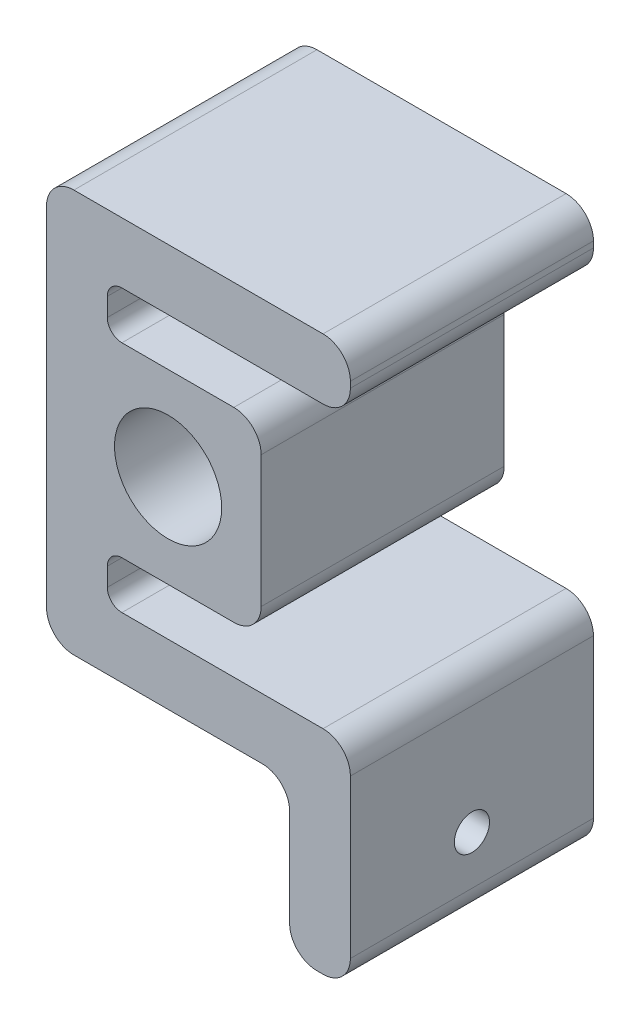
ISO-10303-21;
HEADER;
FILE_DESCRIPTION(('STEP AP214'),'2;1');
FILE_NAME('part.step','',(''),(''),'','','');
FILE_SCHEMA(('AUTOMOTIVE_DESIGN { 1 0 10303 214 1 1 1 1 }'));
ENDSEC;
DATA;
#1=APPLICATION_CONTEXT('core data for automotive mechanical design processes');
#2=APPLICATION_PROTOCOL_DEFINITION('international standard','automotive_design',2000,#1);
#3=PRODUCT_CONTEXT('',#1,'mechanical');
#4=PRODUCT('Part','Part','',(#3));
#5=PRODUCT_RELATED_PRODUCT_CATEGORY('part','',(#4));
#6=PRODUCT_DEFINITION_FORMATION('','',#4);
#7=PRODUCT_DEFINITION_CONTEXT('part definition',#1,'design');
#8=PRODUCT_DEFINITION('design','',#6,#7);
#9=PRODUCT_DEFINITION_SHAPE('','',#8);
#10=(LENGTH_UNIT() NAMED_UNIT(*) SI_UNIT(.MILLI.,.METRE.));
#11=(NAMED_UNIT(*) PLANE_ANGLE_UNIT() SI_UNIT($,.RADIAN.));
#12=(NAMED_UNIT(*) SI_UNIT($,.STERADIAN.) SOLID_ANGLE_UNIT());
#13=UNCERTAINTY_MEASURE_WITH_UNIT(LENGTH_MEASURE(1.E-05),#10,'distance_accuracy_value','');
#14=(GEOMETRIC_REPRESENTATION_CONTEXT(3) GLOBAL_UNCERTAINTY_ASSIGNED_CONTEXT((#13)) GLOBAL_UNIT_ASSIGNED_CONTEXT((#10,
#11,#12)) REPRESENTATION_CONTEXT('',''));
#15=CARTESIAN_POINT('',(0.,0.,0.));
#16=DIRECTION('',(0.,0.,1.));
#17=DIRECTION('',(1.,0.,0.));
#18=AXIS2_PLACEMENT_3D('',#15,#16,#17);
#19=CARTESIAN_POINT('',(-19.685,-36.364999962,50.8));
#20=DIRECTION('',(0.,0.,1.));
#21=DIRECTION('',(1.,0.,0.));
#22=AXIS2_PLACEMENT_3D('',#19,#20,#21);
#23=PLANE('',#22);
#24=CARTESIAN_POINT('',(-19.685,-36.364999962,50.8));
#25=DIRECTION('',(0.,0.,1.));
#26=DIRECTION('',(1.,0.,0.));
#27=AXIS2_PLACEMENT_3D('',#24,#25,#26);
#28=CIRCLE('',#27,5.715);
#29=CARTESIAN_POINT('',(-25.4,-36.364999962,50.8));
#30=VERTEX_POINT('',#29);
#31=CARTESIAN_POINT('',(-19.685,-42.079999962,50.8));
#32=VERTEX_POINT('',#31);
#33=EDGE_CURVE('E319',#30,#32,#28,.T.);
#34=ORIENTED_EDGE('',*,*,#33,.T.);
#35=DIRECTION('',(1.,0.,0.));
#36=VECTOR('',#35,1.);
#37=CARTESIAN_POINT('',(-19.685,-42.079999962,50.8));
#38=LINE('',#37,#36);
#39=CARTESIAN_POINT('',(19.685,-42.079999962,50.8));
#40=VERTEX_POINT('',#39);
#41=EDGE_CURVE('E164',#32,#40,#38,.T.);
#42=ORIENTED_EDGE('',*,*,#41,.T.);
#43=CARTESIAN_POINT('',(19.685,-47.794999962,50.8));
#44=DIRECTION('',(0.,0.,-1.));
#45=DIRECTION('',(-1.,0.,0.));
#46=AXIS2_PLACEMENT_3D('',#43,#44,#45);
#47=CIRCLE('',#46,5.715);
#48=CARTESIAN_POINT('',(25.4,-47.794999962,50.8));
#49=VERTEX_POINT('',#48);
#50=EDGE_CURVE('E395',#40,#49,#47,.T.);
#51=ORIENTED_EDGE('',*,*,#50,.T.);
#52=DIRECTION('',(0.,-1.,0.));
#53=VECTOR('',#52,1.);
#54=CARTESIAN_POINT('',(25.4,-68.114999962,50.8));
#55=LINE('',#54,#53);
#56=CARTESIAN_POINT('',(25.4,-68.114999962,50.8));
#57=VERTEX_POINT('',#56);
#58=EDGE_CURVE('E414',#49,#57,#55,.T.);
#59=ORIENTED_EDGE('',*,*,#58,.T.);
#60=CARTESIAN_POINT('',(31.115,-68.114999962,50.8));
#61=DIRECTION('',(0.,0.,1.));
#62=DIRECTION('',(-1.,0.,0.));
#63=AXIS2_PLACEMENT_3D('',#60,#61,#62);
#64=CIRCLE('',#63,5.71499999999999);
#65=CARTESIAN_POINT('',(31.115,-73.829999962,50.8));
#66=VERTEX_POINT('',#65);
#67=EDGE_CURVE('E411',#57,#66,#64,.T.);
#68=ORIENTED_EDGE('',*,*,#67,.T.);
#69=DIRECTION('',(1.,0.,0.));
#70=VECTOR('',#69,1.);
#71=CARTESIAN_POINT('',(32.385,-73.829999962,50.8));
#72=LINE('',#71,#70);
#73=CARTESIAN_POINT('',(32.385,-73.829999962,50.8));
#74=VERTEX_POINT('',#73);
#75=EDGE_CURVE('E413',#66,#74,#72,.T.);
#76=ORIENTED_EDGE('',*,*,#75,.T.);
#77=CARTESIAN_POINT('',(32.385,-68.114999962,50.8));
#78=DIRECTION('',(0.,0.,1.));
#79=DIRECTION('',(-1.,0.,0.));
#80=AXIS2_PLACEMENT_3D('',#77,#78,#79);
#81=CIRCLE('',#80,5.71499999999999);
#82=CARTESIAN_POINT('',(38.1,-68.114999962,50.8));
#83=VERTEX_POINT('',#82);
#84=EDGE_CURVE('E416',#74,#83,#81,.T.);
#85=ORIENTED_EDGE('',*,*,#84,.T.);
#86=DIRECTION('',(0.,1.,0.));
#87=VECTOR('',#86,1.);
#88=CARTESIAN_POINT('',(38.1,-68.114999962,50.8));
#89=LINE('',#88,#87);
#90=CARTESIAN_POINT('',(38.1,-35.094999962,50.8));
#91=VERTEX_POINT('',#90);
#92=EDGE_CURVE('E422',#83,#91,#89,.T.);
#93=ORIENTED_EDGE('',*,*,#92,.T.);
#94=CARTESIAN_POINT('',(32.385,-35.094999962,50.8));
#95=DIRECTION('',(0.,0.,1.));
#96=DIRECTION('',(1.,0.,0.));
#97=AXIS2_PLACEMENT_3D('',#94,#95,#96);
#98=CIRCLE('',#97,5.71499999999999);
#99=CARTESIAN_POINT('',(32.385,-29.379999962,50.8));
#100=VERTEX_POINT('',#99);
#101=EDGE_CURVE('E424',#91,#100,#98,.T.);
#102=ORIENTED_EDGE('',*,*,#101,.T.);
#103=DIRECTION('',(-1.,0.,0.));
#104=VECTOR('',#103,1.);
#105=CARTESIAN_POINT('',(32.385,-29.379999962,50.8));
#106=LINE('',#105,#104);
#107=CARTESIAN_POINT('',(-9.65199999999999,-29.379999962,50.8));
#108=VERTEX_POINT('',#107);
#109=EDGE_CURVE('E426',#100,#108,#106,.T.);
#110=ORIENTED_EDGE('',*,*,#109,.T.);
#111=CARTESIAN_POINT('',(-9.65199999999999,-26.331999962,50.8));
#112=DIRECTION('',(0.,0.,-1.));
#113=DIRECTION('',(-1.,0.,0.));
#114=AXIS2_PLACEMENT_3D('',#111,#112,#113);
#115=CIRCLE('',#114,3.048);
#116=CARTESIAN_POINT('',(-12.7,-26.331999962,50.8));
#117=VERTEX_POINT('',#116);
#118=EDGE_CURVE('E428',#108,#117,#115,.T.);
#119=ORIENTED_EDGE('',*,*,#118,.T.);
#120=DIRECTION('',(0.,1.,0.));
#121=VECTOR('',#120,1.);
#122=CARTESIAN_POINT('',(-12.7,-26.331999962,50.8));
#123=LINE('',#122,#121);
#124=CARTESIAN_POINT('',(-12.7,-22.503,50.8));
#125=VERTEX_POINT('',#124);
#126=EDGE_CURVE('E430',#117,#125,#123,.T.);
#127=ORIENTED_EDGE('',*,*,#126,.T.);
#128=CARTESIAN_POINT('',(-9.65199999999999,-22.503,50.8));
#129=DIRECTION('',(0.,0.,-1.));
#130=DIRECTION('',(-1.,0.,0.));
#131=AXIS2_PLACEMENT_3D('',#128,#129,#130);
#132=CIRCLE('',#131,3.048);
#133=CARTESIAN_POINT('',(-9.65199999999999,-19.455,50.8));
#134=VERTEX_POINT('',#133);
#135=EDGE_CURVE('E432',#125,#134,#132,.T.);
#136=ORIENTED_EDGE('',*,*,#135,.T.);
#137=DIRECTION('',(1.,0.,0.));
#138=VECTOR('',#137,1.);
#139=CARTESIAN_POINT('',(-9.65199999999999,-19.455,50.8));
#140=LINE('',#139,#138);
#141=CARTESIAN_POINT('',(13.74,-19.455,50.8));
#142=VERTEX_POINT('',#141);
#143=EDGE_CURVE('E434',#134,#142,#140,.T.);
#144=ORIENTED_EDGE('',*,*,#143,.T.);
#145=CARTESIAN_POINT('',(13.74,-13.74,50.8));
#146=DIRECTION('',(0.,0.,1.));
#147=DIRECTION('',(-1.,0.,0.));
#148=AXIS2_PLACEMENT_3D('',#145,#146,#147);
#149=CIRCLE('',#148,5.715);
#150=CARTESIAN_POINT('',(19.455,-13.74,50.8));
#151=VERTEX_POINT('',#150);
#152=EDGE_CURVE('E436',#142,#151,#149,.T.);
#153=ORIENTED_EDGE('',*,*,#152,.T.);
#154=DIRECTION('',(0.,1.,0.));
#155=VECTOR('',#154,1.);
#156=CARTESIAN_POINT('',(19.455,0.,50.8));
#157=LINE('',#156,#155);
#158=CARTESIAN_POINT('',(19.455,13.74,50.8));
#159=VERTEX_POINT('',#158);
#160=EDGE_CURVE('E438',#151,#159,#157,.T.);
#161=ORIENTED_EDGE('',*,*,#160,.T.);
#162=CARTESIAN_POINT('',(13.74,13.74,50.8));
#163=DIRECTION('',(0.,0.,1.));
#164=DIRECTION('',(-1.,0.,0.));
#165=AXIS2_PLACEMENT_3D('',#162,#163,#164);
#166=CIRCLE('',#165,5.715);
#167=CARTESIAN_POINT('',(13.74,19.455,50.8));
#168=VERTEX_POINT('',#167);
#169=EDGE_CURVE('E440',#159,#168,#166,.T.);
#170=ORIENTED_EDGE('',*,*,#169,.T.);
#171=DIRECTION('',(-1.,0.,0.));
#172=VECTOR('',#171,1.);
#173=CARTESIAN_POINT('',(0.,19.455,50.8));
#174=LINE('',#173,#172);
#175=CARTESIAN_POINT('',(-9.65199999999999,19.455,50.8));
#176=VERTEX_POINT('',#175);
#177=EDGE_CURVE('E442',#168,#176,#174,.T.);
#178=ORIENTED_EDGE('',*,*,#177,.T.);
#179=CARTESIAN_POINT('',(-9.65199999999999,22.503,50.8));
#180=DIRECTION('',(0.,0.,-1.));
#181=DIRECTION('',(-1.,0.,0.));
#182=AXIS2_PLACEMENT_3D('',#179,#180,#181);
#183=CIRCLE('',#182,3.048);
#184=CARTESIAN_POINT('',(-12.7,22.503,50.8));
#185=VERTEX_POINT('',#184);
#186=EDGE_CURVE('E444',#176,#185,#183,.T.);
#187=ORIENTED_EDGE('',*,*,#186,.T.);
#188=DIRECTION('',(0.,1.,0.));
#189=VECTOR('',#188,1.);
#190=CARTESIAN_POINT('',(-12.7,22.503,50.8));
#191=LINE('',#190,#189);
#192=CARTESIAN_POINT('',(-12.7,26.332,50.8));
#193=VERTEX_POINT('',#192);
#194=EDGE_CURVE('E446',#185,#193,#191,.T.);
#195=ORIENTED_EDGE('',*,*,#194,.T.);
#196=CARTESIAN_POINT('',(-9.65199999999999,26.332,50.8));
#197=DIRECTION('',(0.,0.,-1.));
#198=DIRECTION('',(-1.,0.,0.));
#199=AXIS2_PLACEMENT_3D('',#196,#197,#198);
#200=CIRCLE('',#199,3.048);
#201=CARTESIAN_POINT('',(-9.65199999999999,29.38,50.8));
#202=VERTEX_POINT('',#201);
#203=EDGE_CURVE('E448',#193,#202,#200,.T.);
#204=ORIENTED_EDGE('',*,*,#203,.T.);
#205=DIRECTION('',(1.,0.,0.));
#206=VECTOR('',#205,1.);
#207=CARTESIAN_POINT('',(-9.65199999999999,29.38,50.8));
#208=LINE('',#207,#206);
#209=CARTESIAN_POINT('',(32.385,29.38,50.8));
#210=VERTEX_POINT('',#209);
#211=EDGE_CURVE('E450',#202,#210,#208,.T.);
#212=ORIENTED_EDGE('',*,*,#211,.T.);
#213=CARTESIAN_POINT('',(32.385,35.095,50.8));
#214=DIRECTION('',(0.,0.,1.));
#215=DIRECTION('',(1.,0.,0.));
#216=AXIS2_PLACEMENT_3D('',#213,#214,#215);
#217=CIRCLE('',#216,5.715);
#218=CARTESIAN_POINT('',(38.1,35.095,50.8));
#219=VERTEX_POINT('',#218);
#220=EDGE_CURVE('E452',#210,#219,#217,.T.);
#221=ORIENTED_EDGE('',*,*,#220,.T.);
#222=DIRECTION('',(0.,1.,0.));
#223=VECTOR('',#222,1.);
#224=CARTESIAN_POINT('',(38.1,35.095,50.8));
#225=LINE('',#224,#223);
#226=CARTESIAN_POINT('',(38.1,36.365,50.8));
#227=VERTEX_POINT('',#226);
#228=EDGE_CURVE('E454',#219,#227,#225,.T.);
#229=ORIENTED_EDGE('',*,*,#228,.T.);
#230=CARTESIAN_POINT('',(32.385,36.365,50.8));
#231=DIRECTION('',(0.,0.,1.));
#232=DIRECTION('',(1.,0.,0.));
#233=AXIS2_PLACEMENT_3D('',#230,#231,#232);
#234=CIRCLE('',#233,5.715);
#235=CARTESIAN_POINT('',(32.385,42.08,50.8));
#236=VERTEX_POINT('',#235);
#237=EDGE_CURVE('E243',#227,#236,#234,.T.);
#238=ORIENTED_EDGE('',*,*,#237,.T.);
#239=DIRECTION('',(-1.,0.,0.));
#240=VECTOR('',#239,1.);
#241=CARTESIAN_POINT('',(32.385,42.08,50.8));
#242=LINE('',#241,#240);
#243=CARTESIAN_POINT('',(-19.685,42.08,50.8));
#244=VERTEX_POINT('',#243);
#245=EDGE_CURVE('E237',#236,#244,#242,.T.);
#246=ORIENTED_EDGE('',*,*,#245,.T.);
#247=CARTESIAN_POINT('',(-19.685,36.365,50.8));
#248=DIRECTION('',(0.,0.,1.));
#249=DIRECTION('',(1.,0.,0.));
#250=AXIS2_PLACEMENT_3D('',#247,#248,#249);
#251=CIRCLE('',#250,5.71499999999999);
#252=CARTESIAN_POINT('',(-25.4,36.365,50.8));
#253=VERTEX_POINT('',#252);
#254=EDGE_CURVE('E241',#244,#253,#251,.T.);
#255=ORIENTED_EDGE('',*,*,#254,.T.);
#256=DIRECTION('',(0.,-1.,0.));
#257=VECTOR('',#256,1.);
#258=CARTESIAN_POINT('',(-25.4,-36.364999962,50.8));
#259=LINE('',#258,#257);
#260=EDGE_CURVE('E61',#253,#30,#259,.T.);
#261=ORIENTED_EDGE('',*,*,#260,.T.);
#262=EDGE_LOOP('',(#34,#42,#51,#59,#68,#76,#85,#93,#102,#110,#119,#127,#136,#144,#153,#161,#170,
#178,#187,#195,#204,#212,#221,#229,#238,#246,#255,#261));
#263=FACE_BOUND('',#262,.T.);
#264=CARTESIAN_POINT('',(0.,0.,50.8));
#265=DIRECTION('',(0.,0.,1.));
#266=DIRECTION('',(1.,0.,0.));
#267=AXIS2_PLACEMENT_3D('',#264,#265,#266);
#268=CIRCLE('',#267,11.2);
#269=CARTESIAN_POINT('',(11.2,0.,50.8));
#270=VERTEX_POINT('',#269);
#271=EDGE_CURVE('E265',#270,#270,#268,.T.);
#272=ORIENTED_EDGE('',*,*,#271,.F.);
#273=EDGE_LOOP('',(#272));
#274=FACE_BOUND('',#273,.T.);
#275=ADVANCED_FACE('F43',(#263,#274),#23,.T.);
#276=CARTESIAN_POINT('',(-19.685,-36.364999962,0.));
#277=DIRECTION('',(0.,0.,1.));
#278=DIRECTION('',(1.,0.,0.));
#279=AXIS2_PLACEMENT_3D('',#276,#277,#278);
#280=PLANE('',#279);
#281=CARTESIAN_POINT('',(-19.685,-36.364999962,0.));
#282=DIRECTION('',(0.,0.,1.));
#283=DIRECTION('',(1.,0.,0.));
#284=AXIS2_PLACEMENT_3D('',#281,#282,#283);
#285=CIRCLE('',#284,5.715);
#286=CARTESIAN_POINT('',(-25.4,-36.364999962,0.));
#287=VERTEX_POINT('',#286);
#288=CARTESIAN_POINT('',(-19.685,-42.079999962,0.));
#289=VERTEX_POINT('',#288);
#290=EDGE_CURVE('E261',#287,#289,#285,.T.);
#291=ORIENTED_EDGE('',*,*,#290,.F.);
#292=DIRECTION('',(0.,-1.,0.));
#293=VECTOR('',#292,1.);
#294=CARTESIAN_POINT('',(-25.4,-36.364999962,0.));
#295=LINE('',#294,#293);
#296=CARTESIAN_POINT('',(-25.4,36.365,0.));
#297=VERTEX_POINT('',#296);
#298=EDGE_CURVE('E156',#297,#287,#295,.T.);
#299=ORIENTED_EDGE('',*,*,#298,.F.);
#300=CARTESIAN_POINT('',(-19.685,36.365,0.));
#301=DIRECTION('',(0.,0.,1.));
#302=DIRECTION('',(1.,0.,0.));
#303=AXIS2_PLACEMENT_3D('',#300,#301,#302);
#304=CIRCLE('',#303,5.71499999999999);
#305=CARTESIAN_POINT('',(-19.685,42.08,0.));
#306=VERTEX_POINT('',#305);
#307=EDGE_CURVE('E150',#306,#297,#304,.T.);
#308=ORIENTED_EDGE('',*,*,#307,.F.);
#309=DIRECTION('',(-1.,0.,0.));
#310=VECTOR('',#309,1.);
#311=CARTESIAN_POINT('',(32.385,42.08,0.));
#312=LINE('',#311,#310);
#313=CARTESIAN_POINT('',(32.385,42.08,0.));
#314=VERTEX_POINT('',#313);
#315=EDGE_CURVE('E251',#314,#306,#312,.T.);
#316=ORIENTED_EDGE('',*,*,#315,.F.);
#317=CARTESIAN_POINT('',(32.385,36.365,0.));
#318=DIRECTION('',(0.,0.,1.));
#319=DIRECTION('',(1.,0.,0.));
#320=AXIS2_PLACEMENT_3D('',#317,#318,#319);
#321=CIRCLE('',#320,5.715);
#322=CARTESIAN_POINT('',(38.1,36.365,0.));
#323=VERTEX_POINT('',#322);
#324=EDGE_CURVE('E314',#323,#314,#321,.T.);
#325=ORIENTED_EDGE('',*,*,#324,.F.);
#326=DIRECTION('',(0.,1.,0.));
#327=VECTOR('',#326,1.);
#328=CARTESIAN_POINT('',(38.1,35.095,0.));
#329=LINE('',#328,#327);
#330=CARTESIAN_POINT('',(38.1,35.095,0.));
#331=VERTEX_POINT('',#330);
#332=EDGE_CURVE('E312',#331,#323,#329,.T.);
#333=ORIENTED_EDGE('',*,*,#332,.F.);
#334=CARTESIAN_POINT('',(32.385,35.095,0.));
#335=DIRECTION('',(0.,0.,1.));
#336=DIRECTION('',(1.,0.,0.));
#337=AXIS2_PLACEMENT_3D('',#334,#335,#336);
#338=CIRCLE('',#337,5.715);
#339=CARTESIAN_POINT('',(32.385,29.38,0.));
#340=VERTEX_POINT('',#339);
#341=EDGE_CURVE('E310',#340,#331,#338,.T.);
#342=ORIENTED_EDGE('',*,*,#341,.F.);
#343=DIRECTION('',(1.,0.,0.));
#344=VECTOR('',#343,1.);
#345=CARTESIAN_POINT('',(-9.65199999999999,29.38,0.));
#346=LINE('',#345,#344);
#347=CARTESIAN_POINT('',(-9.65199999999999,29.38,0.));
#348=VERTEX_POINT('',#347);
#349=EDGE_CURVE('E308',#348,#340,#346,.T.);
#350=ORIENTED_EDGE('',*,*,#349,.F.);
#351=CARTESIAN_POINT('',(-9.65199999999999,26.332,0.));
#352=DIRECTION('',(0.,0.,-1.));
#353=DIRECTION('',(-1.,0.,0.));
#354=AXIS2_PLACEMENT_3D('',#351,#352,#353);
#355=CIRCLE('',#354,3.048);
#356=CARTESIAN_POINT('',(-12.7,26.332,0.));
#357=VERTEX_POINT('',#356);
#358=EDGE_CURVE('E306',#357,#348,#355,.T.);
#359=ORIENTED_EDGE('',*,*,#358,.F.);
#360=DIRECTION('',(0.,1.,0.));
#361=VECTOR('',#360,1.);
#362=CARTESIAN_POINT('',(-12.7,22.503,0.));
#363=LINE('',#362,#361);
#364=CARTESIAN_POINT('',(-12.7,22.503,0.));
#365=VERTEX_POINT('',#364);
#366=EDGE_CURVE('E304',#365,#357,#363,.T.);
#367=ORIENTED_EDGE('',*,*,#366,.F.);
#368=CARTESIAN_POINT('',(-9.65199999999999,22.503,0.));
#369=DIRECTION('',(0.,0.,-1.));
#370=DIRECTION('',(-1.,0.,0.));
#371=AXIS2_PLACEMENT_3D('',#368,#369,#370);
#372=CIRCLE('',#371,3.048);
#373=CARTESIAN_POINT('',(-9.65199999999999,19.455,0.));
#374=VERTEX_POINT('',#373);
#375=EDGE_CURVE('E302',#374,#365,#372,.T.);
#376=ORIENTED_EDGE('',*,*,#375,.F.);
#377=DIRECTION('',(-1.,0.,0.));
#378=VECTOR('',#377,1.);
#379=CARTESIAN_POINT('',(-9.65199999999999,19.455,0.));
#380=LINE('',#379,#378);
#381=CARTESIAN_POINT('',(13.74,19.455,0.));
#382=VERTEX_POINT('',#381);
#383=EDGE_CURVE('E300',#382,#374,#380,.T.);
#384=ORIENTED_EDGE('',*,*,#383,.F.);
#385=CARTESIAN_POINT('',(13.74,13.74,0.));
#386=DIRECTION('',(0.,0.,1.));
#387=DIRECTION('',(-1.,0.,0.));
#388=AXIS2_PLACEMENT_3D('',#385,#386,#387);
#389=CIRCLE('',#388,5.715);
#390=CARTESIAN_POINT('',(19.455,13.74,0.));
#391=VERTEX_POINT('',#390);
#392=EDGE_CURVE('E297',#391,#382,#389,.T.);
#393=ORIENTED_EDGE('',*,*,#392,.F.);
#394=DIRECTION('',(0.,1.,0.));
#395=VECTOR('',#394,1.);
#396=CARTESIAN_POINT('',(19.455,13.74,0.));
#397=LINE('',#396,#395);
#398=CARTESIAN_POINT('',(19.455,-13.74,0.));
#399=VERTEX_POINT('',#398);
#400=EDGE_CURVE('E295',#399,#391,#397,.T.);
#401=ORIENTED_EDGE('',*,*,#400,.F.);
#402=CARTESIAN_POINT('',(13.74,-13.74,0.));
#403=DIRECTION('',(0.,0.,1.));
#404=DIRECTION('',(-1.,0.,0.));
#405=AXIS2_PLACEMENT_3D('',#402,#403,#404);
#406=CIRCLE('',#405,5.715);
#407=CARTESIAN_POINT('',(13.74,-19.455,0.));
#408=VERTEX_POINT('',#407);
#409=EDGE_CURVE('E292',#408,#399,#406,.T.);
#410=ORIENTED_EDGE('',*,*,#409,.F.);
#411=DIRECTION('',(1.,0.,0.));
#412=VECTOR('',#411,1.);
#413=CARTESIAN_POINT('',(13.74,-19.455,0.));
#414=LINE('',#413,#412);
#415=CARTESIAN_POINT('',(-9.65199999999999,-19.455,0.));
#416=VERTEX_POINT('',#415);
#417=EDGE_CURVE('E290',#416,#408,#414,.T.);
#418=ORIENTED_EDGE('',*,*,#417,.F.);
#419=CARTESIAN_POINT('',(-9.65199999999999,-22.503,0.));
#420=DIRECTION('',(0.,0.,-1.));
#421=DIRECTION('',(-1.,0.,0.));
#422=AXIS2_PLACEMENT_3D('',#419,#420,#421);
#423=CIRCLE('',#422,3.048);
#424=CARTESIAN_POINT('',(-12.7,-22.503,0.));
#425=VERTEX_POINT('',#424);
#426=EDGE_CURVE('E287',#425,#416,#423,.T.);
#427=ORIENTED_EDGE('',*,*,#426,.F.);
#428=DIRECTION('',(0.,1.,0.));
#429=VECTOR('',#428,1.);
#430=CARTESIAN_POINT('',(-12.7,-26.331999962,0.));
#431=LINE('',#430,#429);
#432=CARTESIAN_POINT('',(-12.7,-26.331999962,0.));
#433=VERTEX_POINT('',#432);
#434=EDGE_CURVE('E285',#433,#425,#431,.T.);
#435=ORIENTED_EDGE('',*,*,#434,.F.);
#436=CARTESIAN_POINT('',(-9.65199999999999,-26.331999962,0.));
#437=DIRECTION('',(0.,0.,-1.));
#438=DIRECTION('',(-1.,0.,0.));
#439=AXIS2_PLACEMENT_3D('',#436,#437,#438);
#440=CIRCLE('',#439,3.048);
#441=CARTESIAN_POINT('',(-9.65199999999999,-29.379999962,0.));
#442=VERTEX_POINT('',#441);
#443=EDGE_CURVE('E283',#442,#433,#440,.T.);
#444=ORIENTED_EDGE('',*,*,#443,.F.);
#445=DIRECTION('',(-1.,0.,0.));
#446=VECTOR('',#445,1.);
#447=CARTESIAN_POINT('',(32.385,-29.379999962,0.));
#448=LINE('',#447,#446);
#449=CARTESIAN_POINT('',(32.385,-29.379999962,0.));
#450=VERTEX_POINT('',#449);
#451=EDGE_CURVE('E281',#450,#442,#448,.T.);
#452=ORIENTED_EDGE('',*,*,#451,.F.);
#453=CARTESIAN_POINT('',(32.385,-35.094999962,0.));
#454=DIRECTION('',(0.,0.,1.));
#455=DIRECTION('',(1.,0.,0.));
#456=AXIS2_PLACEMENT_3D('',#453,#454,#455);
#457=CIRCLE('',#456,5.71499999999999);
#458=CARTESIAN_POINT('',(38.1,-35.094999962,0.));
#459=VERTEX_POINT('',#458);
#460=EDGE_CURVE('E279',#459,#450,#457,.T.);
#461=ORIENTED_EDGE('',*,*,#460,.F.);
#462=DIRECTION('',(0.,1.,0.));
#463=VECTOR('',#462,1.);
#464=CARTESIAN_POINT('',(38.1,-68.114999962,0.));
#465=LINE('',#464,#463);
#466=CARTESIAN_POINT('',(38.1,-68.114999962,0.));
#467=VERTEX_POINT('',#466);
#468=EDGE_CURVE('E277',#467,#459,#465,.T.);
#469=ORIENTED_EDGE('',*,*,#468,.F.);
#470=CARTESIAN_POINT('',(32.385,-68.114999962,0.));
#471=DIRECTION('',(0.,0.,1.));
#472=DIRECTION('',(-1.,0.,0.));
#473=AXIS2_PLACEMENT_3D('',#470,#471,#472);
#474=CIRCLE('',#473,5.71499999999999);
#475=CARTESIAN_POINT('',(32.385,-73.829999962,0.));
#476=VERTEX_POINT('',#475);
#477=EDGE_CURVE('E275',#476,#467,#474,.T.);
#478=ORIENTED_EDGE('',*,*,#477,.F.);
#479=DIRECTION('',(1.,0.,0.));
#480=VECTOR('',#479,1.);
#481=CARTESIAN_POINT('',(32.385,-73.829999962,0.));
#482=LINE('',#481,#480);
#483=CARTESIAN_POINT('',(31.115,-73.829999962,0.));
#484=VERTEX_POINT('',#483);
#485=EDGE_CURVE('E273',#484,#476,#482,.T.);
#486=ORIENTED_EDGE('',*,*,#485,.F.);
#487=CARTESIAN_POINT('',(31.115,-68.114999962,0.));
#488=DIRECTION('',(0.,0.,1.));
#489=DIRECTION('',(-1.,0.,0.));
#490=AXIS2_PLACEMENT_3D('',#487,#488,#489);
#491=CIRCLE('',#490,5.71499999999999);
#492=CARTESIAN_POINT('',(25.4,-68.114999962,0.));
#493=VERTEX_POINT('',#492);
#494=EDGE_CURVE('E271',#493,#484,#491,.T.);
#495=ORIENTED_EDGE('',*,*,#494,.F.);
#496=DIRECTION('',(0.,-1.,0.));
#497=VECTOR('',#496,1.);
#498=CARTESIAN_POINT('',(25.4,-68.114999962,0.));
#499=LINE('',#498,#497);
#500=CARTESIAN_POINT('',(25.4,-47.794999962,0.));
#501=VERTEX_POINT('',#500);
#502=EDGE_CURVE('E269',#501,#493,#499,.T.);
#503=ORIENTED_EDGE('',*,*,#502,.F.);
#504=CARTESIAN_POINT('',(19.685,-47.794999962,0.));
#505=DIRECTION('',(0.,0.,-1.));
#506=DIRECTION('',(-1.,0.,0.));
#507=AXIS2_PLACEMENT_3D('',#504,#505,#506);
#508=CIRCLE('',#507,5.715);
#509=CARTESIAN_POINT('',(19.685,-42.079999962,0.));
#510=VERTEX_POINT('',#509);
#511=EDGE_CURVE('E267',#510,#501,#508,.T.);
#512=ORIENTED_EDGE('',*,*,#511,.F.);
#513=DIRECTION('',(1.,0.,0.));
#514=VECTOR('',#513,1.);
#515=CARTESIAN_POINT('',(-19.685,-42.079999962,0.));
#516=LINE('',#515,#514);
#517=EDGE_CURVE('E264',#289,#510,#516,.T.);
#518=ORIENTED_EDGE('',*,*,#517,.F.);
#519=EDGE_LOOP('',(#291,#299,#308,#316,#325,#333,#342,#350,#359,#367,#376,#384,#393,#401,#410,
#418,#427,#435,#444,#452,#461,#469,#478,#486,#495,#503,#512,#518));
#520=FACE_BOUND('',#519,.T.);
#521=CARTESIAN_POINT('',(0.,0.,0.));
#522=DIRECTION('',(0.,0.,1.));
#523=DIRECTION('',(1.,0.,0.));
#524=AXIS2_PLACEMENT_3D('',#521,#522,#523);
#525=CIRCLE('',#524,11.2);
#526=CARTESIAN_POINT('',(11.2,0.,0.));
#527=VERTEX_POINT('',#526);
#528=EDGE_CURVE('E499',#527,#527,#525,.T.);
#529=ORIENTED_EDGE('',*,*,#528,.T.);
#530=EDGE_LOOP('',(#529));
#531=FACE_BOUND('',#530,.T.);
#532=ADVANCED_FACE('F399',(#520,#531),#280,.F.);
#533=CARTESIAN_POINT('',(-19.685,-36.364999962,50.8));
#534=DIRECTION('',(0.,0.,-1.));
#535=DIRECTION('',(-1.,0.,0.));
#536=AXIS2_PLACEMENT_3D('',#533,#534,#535);
#537=CYLINDRICAL_SURFACE('',#536,5.715);
#538=ORIENTED_EDGE('',*,*,#290,.T.);
#539=DIRECTION('',(0.,0.,-1.));
#540=VECTOR('',#539,1.);
#541=CARTESIAN_POINT('',(-19.685,-42.079999962,50.8));
#542=LINE('',#541,#540);
#543=EDGE_CURVE('E11',#32,#289,#542,.T.);
#544=ORIENTED_EDGE('',*,*,#543,.F.);
#545=ORIENTED_EDGE('',*,*,#33,.F.);
#546=DIRECTION('',(0.,0.,-1.));
#547=VECTOR('',#546,1.);
#548=CARTESIAN_POINT('',(-25.4,-36.364999962,50.8));
#549=LINE('',#548,#547);
#550=EDGE_CURVE('E257',#30,#287,#549,.T.);
#551=ORIENTED_EDGE('',*,*,#550,.T.);
#552=EDGE_LOOP('',(#538,#544,#545,#551));
#553=FACE_BOUND('',#552,.T.);
#554=ADVANCED_FACE('F45',(#553),#537,.T.);
#555=CARTESIAN_POINT('',(-19.685,-42.079999962,50.8));
#556=DIRECTION('',(0.,1.,0.));
#557=DIRECTION('',(0.,0.,1.));
#558=AXIS2_PLACEMENT_3D('',#555,#556,#557);
#559=PLANE('',#558);
#560=ORIENTED_EDGE('',*,*,#517,.T.);
#561=DIRECTION('',(0.,0.,-1.));
#562=VECTOR('',#561,1.);
#563=CARTESIAN_POINT('',(19.685,-42.079999962,50.8));
#564=LINE('',#563,#562);
#565=EDGE_CURVE('E53',#40,#510,#564,.T.);
#566=ORIENTED_EDGE('',*,*,#565,.F.);
#567=ORIENTED_EDGE('',*,*,#41,.F.);
#568=ORIENTED_EDGE('',*,*,#543,.T.);
#569=EDGE_LOOP('',(#560,#566,#567,#568));
#570=FACE_BOUND('',#569,.T.);
#571=ADVANCED_FACE('F519',(#570),#559,.F.);
#572=CARTESIAN_POINT('',(19.685,-47.794999962,50.8));
#573=DIRECTION('',(0.,0.,-1.));
#574=DIRECTION('',(-1.,0.,0.));
#575=AXIS2_PLACEMENT_3D('',#572,#573,#574);
#576=CYLINDRICAL_SURFACE('',#575,5.715);
#577=ORIENTED_EDGE('',*,*,#511,.T.);
#578=DIRECTION('',(0.,0.,-1.));
#579=VECTOR('',#578,1.);
#580=CARTESIAN_POINT('',(25.4,-47.794999962,50.8));
#581=LINE('',#580,#579);
#582=EDGE_CURVE('E386',#49,#501,#581,.T.);
#583=ORIENTED_EDGE('',*,*,#582,.F.);
#584=ORIENTED_EDGE('',*,*,#50,.F.);
#585=ORIENTED_EDGE('',*,*,#565,.T.);
#586=EDGE_LOOP('',(#577,#583,#584,#585));
#587=FACE_BOUND('',#586,.T.);
#588=ADVANCED_FACE('F393',(#587),#576,.F.);
#589=CARTESIAN_POINT('',(25.4,-68.114999962,50.8));
#590=DIRECTION('',(1.,0.,0.));
#591=DIRECTION('',(0.,1.,0.));
#592=AXIS2_PLACEMENT_3D('',#589,#590,#591);
#593=PLANE('',#592);
#594=CARTESIAN_POINT('',(25.4,-57.954999962,25.4));
#595=DIRECTION('',(1.,0.,0.));
#596=DIRECTION('',(0.,0.,-1.));
#597=AXIS2_PLACEMENT_3D('',#594,#595,#596);
#598=CIRCLE('',#597,3.675);
#599=CARTESIAN_POINT('',(25.4,-57.954999962,21.725));
#600=VERTEX_POINT('',#599);
#601=EDGE_CURVE('E495',#600,#600,#598,.T.);
#602=ORIENTED_EDGE('',*,*,#601,.T.);
#603=EDGE_LOOP('',(#602));
#604=FACE_BOUND('',#603,.T.);
#605=ORIENTED_EDGE('',*,*,#502,.T.);
#606=DIRECTION('',(0.,0.,-1.));
#607=VECTOR('',#606,1.);
#608=CARTESIAN_POINT('',(25.4,-68.114999962,50.8));
#609=LINE('',#608,#607);
#610=EDGE_CURVE('E383',#57,#493,#609,.T.);
#611=ORIENTED_EDGE('',*,*,#610,.F.);
#612=ORIENTED_EDGE('',*,*,#58,.F.);
#613=ORIENTED_EDGE('',*,*,#582,.T.);
#614=EDGE_LOOP('',(#605,#611,#612,#613));
#615=FACE_BOUND('',#614,.T.);
#616=ADVANCED_FACE('F405',(#604,#615),#593,.F.);
#617=CARTESIAN_POINT('',(31.115,-68.114999962,50.8));
#618=DIRECTION('',(0.,0.,-1.));
#619=DIRECTION('',(-1.,0.,0.));
#620=AXIS2_PLACEMENT_3D('',#617,#618,#619);
#621=CYLINDRICAL_SURFACE('',#620,5.71499999999999);
#622=ORIENTED_EDGE('',*,*,#494,.T.);
#623=DIRECTION('',(0.,0.,-1.));
#624=VECTOR('',#623,1.);
#625=CARTESIAN_POINT('',(31.115,-73.829999962,50.8));
#626=LINE('',#625,#624);
#627=EDGE_CURVE('E380',#66,#484,#626,.T.);
#628=ORIENTED_EDGE('',*,*,#627,.F.);
#629=ORIENTED_EDGE('',*,*,#67,.F.);
#630=ORIENTED_EDGE('',*,*,#610,.T.);
#631=EDGE_LOOP('',(#622,#628,#629,#630));
#632=FACE_BOUND('',#631,.T.);
#633=ADVANCED_FACE('F409',(#632),#621,.T.);
#634=CARTESIAN_POINT('',(32.385,-73.829999962,50.8));
#635=DIRECTION('',(0.,1.,0.));
#636=DIRECTION('',(0.,0.,1.));
#637=AXIS2_PLACEMENT_3D('',#634,#635,#636);
#638=PLANE('',#637);
#639=ORIENTED_EDGE('',*,*,#485,.T.);
#640=DIRECTION('',(0.,0.,-1.));
#641=VECTOR('',#640,1.);
#642=CARTESIAN_POINT('',(32.385,-73.829999962,50.8));
#643=LINE('',#642,#641);
#644=EDGE_CURVE('E377',#74,#476,#643,.T.);
#645=ORIENTED_EDGE('',*,*,#644,.F.);
#646=ORIENTED_EDGE('',*,*,#75,.F.);
#647=ORIENTED_EDGE('',*,*,#627,.T.);
#648=EDGE_LOOP('',(#639,#645,#646,#647));
#649=FACE_BOUND('',#648,.T.);
#650=ADVANCED_FACE('F516',(#649),#638,.F.);
#651=CARTESIAN_POINT('',(32.385,-68.114999962,50.8));
#652=DIRECTION('',(0.,0.,-1.));
#653=DIRECTION('',(-1.,0.,0.));
#654=AXIS2_PLACEMENT_3D('',#651,#652,#653);
#655=CYLINDRICAL_SURFACE('',#654,5.71499999999999);
#656=ORIENTED_EDGE('',*,*,#477,.T.);
#657=DIRECTION('',(0.,0.,-1.));
#658=VECTOR('',#657,1.);
#659=CARTESIAN_POINT('',(38.1,-68.114999962,50.8));
#660=LINE('',#659,#658);
#661=EDGE_CURVE('E374',#83,#467,#660,.T.);
#662=ORIENTED_EDGE('',*,*,#661,.F.);
#663=ORIENTED_EDGE('',*,*,#84,.F.);
#664=ORIENTED_EDGE('',*,*,#644,.T.);
#665=EDGE_LOOP('',(#656,#662,#663,#664));
#666=FACE_BOUND('',#665,.T.);
#667=ADVANCED_FACE('F565',(#666),#655,.T.);
#668=CARTESIAN_POINT('',(38.1,-68.114999962,50.8));
#669=DIRECTION('',(-1.,0.,0.));
#670=DIRECTION('',(0.,0.,1.));
#671=AXIS2_PLACEMENT_3D('',#668,#669,#670);
#672=PLANE('',#671);
#673=CARTESIAN_POINT('',(38.1,-57.954999962,25.4));
#674=DIRECTION('',(-1.,0.,0.));
#675=DIRECTION('',(0.,0.,1.));
#676=AXIS2_PLACEMENT_3D('',#673,#674,#675);
#677=CIRCLE('',#676,3.675);
#678=CARTESIAN_POINT('',(38.1,-57.954999962,29.075));
#679=VERTEX_POINT('',#678);
#680=EDGE_CURVE('E47',#679,#679,#677,.F.);
#681=ORIENTED_EDGE('',*,*,#680,.F.);
#682=EDGE_LOOP('',(#681));
#683=FACE_BOUND('',#682,.T.);
#684=ORIENTED_EDGE('',*,*,#468,.T.);
#685=DIRECTION('',(0.,0.,-1.));
#686=VECTOR('',#685,1.);
#687=CARTESIAN_POINT('',(38.1,-35.094999962,50.8));
#688=LINE('',#687,#686);
#689=EDGE_CURVE('E371',#91,#459,#688,.T.);
#690=ORIENTED_EDGE('',*,*,#689,.F.);
#691=ORIENTED_EDGE('',*,*,#92,.F.);
#692=ORIENTED_EDGE('',*,*,#661,.T.);
#693=EDGE_LOOP('',(#684,#690,#691,#692));
#694=FACE_BOUND('',#693,.T.);
#695=ADVANCED_FACE('F573',(#683,#694),#672,.F.);
#696=CARTESIAN_POINT('',(32.385,-35.094999962,50.8));
#697=DIRECTION('',(0.,0.,-1.));
#698=DIRECTION('',(-1.,0.,0.));
#699=AXIS2_PLACEMENT_3D('',#696,#697,#698);
#700=CYLINDRICAL_SURFACE('',#699,5.71499999999999);
#701=ORIENTED_EDGE('',*,*,#460,.T.);
#702=DIRECTION('',(0.,0.,-1.));
#703=VECTOR('',#702,1.);
#704=CARTESIAN_POINT('',(32.385,-29.379999962,50.8));
#705=LINE('',#704,#703);
#706=EDGE_CURVE('E368',#100,#450,#705,.T.);
#707=ORIENTED_EDGE('',*,*,#706,.F.);
#708=ORIENTED_EDGE('',*,*,#101,.F.);
#709=ORIENTED_EDGE('',*,*,#689,.T.);
#710=EDGE_LOOP('',(#701,#707,#708,#709));
#711=FACE_BOUND('',#710,.T.);
#712=ADVANCED_FACE('F581',(#711),#700,.T.);
#713=CARTESIAN_POINT('',(32.385,-29.379999962,50.8));
#714=DIRECTION('',(0.,-1.,0.));
#715=DIRECTION('',(1.,0.,0.));
#716=AXIS2_PLACEMENT_3D('',#713,#714,#715);
#717=PLANE('',#716);
#718=ORIENTED_EDGE('',*,*,#451,.T.);
#719=DIRECTION('',(0.,0.,-1.));
#720=VECTOR('',#719,1.);
#721=CARTESIAN_POINT('',(-9.65199999999999,-29.379999962,50.8));
#722=LINE('',#721,#720);
#723=EDGE_CURVE('E365',#108,#442,#722,.T.);
#724=ORIENTED_EDGE('',*,*,#723,.F.);
#725=ORIENTED_EDGE('',*,*,#109,.F.);
#726=ORIENTED_EDGE('',*,*,#706,.T.);
#727=EDGE_LOOP('',(#718,#724,#725,#726));
#728=FACE_BOUND('',#727,.T.);
#729=ADVANCED_FACE('F589',(#728),#717,.F.);
#730=CARTESIAN_POINT('',(-9.65199999999999,-26.331999962,50.8));
#731=DIRECTION('',(0.,0.,-1.));
#732=DIRECTION('',(-1.,0.,0.));
#733=AXIS2_PLACEMENT_3D('',#730,#731,#732);
#734=CYLINDRICAL_SURFACE('',#733,3.048);
#735=ORIENTED_EDGE('',*,*,#443,.T.);
#736=DIRECTION('',(0.,0.,-1.));
#737=VECTOR('',#736,1.);
#738=CARTESIAN_POINT('',(-12.7,-26.331999962,50.8));
#739=LINE('',#738,#737);
#740=EDGE_CURVE('E362',#117,#433,#739,.T.);
#741=ORIENTED_EDGE('',*,*,#740,.F.);
#742=ORIENTED_EDGE('',*,*,#118,.F.);
#743=ORIENTED_EDGE('',*,*,#723,.T.);
#744=EDGE_LOOP('',(#735,#741,#742,#743));
#745=FACE_BOUND('',#744,.T.);
#746=ADVANCED_FACE('F598',(#745),#734,.F.);
#747=CARTESIAN_POINT('',(-12.7,-26.331999962,50.8));
#748=DIRECTION('',(-1.,0.,0.));
#749=DIRECTION('',(0.,0.,1.));
#750=AXIS2_PLACEMENT_3D('',#747,#748,#749);
#751=PLANE('',#750);
#752=ORIENTED_EDGE('',*,*,#434,.T.);
#753=DIRECTION('',(0.,0.,-1.));
#754=VECTOR('',#753,1.);
#755=CARTESIAN_POINT('',(-12.7,-22.503,50.8));
#756=LINE('',#755,#754);
#757=EDGE_CURVE('E359',#125,#425,#756,.T.);
#758=ORIENTED_EDGE('',*,*,#757,.F.);
#759=ORIENTED_EDGE('',*,*,#126,.F.);
#760=ORIENTED_EDGE('',*,*,#740,.T.);
#761=EDGE_LOOP('',(#752,#758,#759,#760));
#762=FACE_BOUND('',#761,.T.);
#763=ADVANCED_FACE('F607',(#762),#751,.F.);
#764=CARTESIAN_POINT('',(-9.65199999999999,-22.503,50.8));
#765=DIRECTION('',(0.,0.,-1.));
#766=DIRECTION('',(-1.,0.,0.));
#767=AXIS2_PLACEMENT_3D('',#764,#765,#766);
#768=CYLINDRICAL_SURFACE('',#767,3.048);
#769=ORIENTED_EDGE('',*,*,#426,.T.);
#770=DIRECTION('',(0.,0.,-1.));
#771=VECTOR('',#770,1.);
#772=CARTESIAN_POINT('',(-9.65199999999999,-19.455,50.8));
#773=LINE('',#772,#771);
#774=EDGE_CURVE('E356',#134,#416,#773,.T.);
#775=ORIENTED_EDGE('',*,*,#774,.F.);
#776=ORIENTED_EDGE('',*,*,#135,.F.);
#777=ORIENTED_EDGE('',*,*,#757,.T.);
#778=EDGE_LOOP('',(#769,#775,#776,#777));
#779=FACE_BOUND('',#778,.T.);
#780=ADVANCED_FACE('F616',(#779),#768,.F.);
#781=CARTESIAN_POINT('',(13.74,-19.455,50.8));
#782=DIRECTION('',(0.,1.,0.));
#783=DIRECTION('',(-1.,0.,0.));
#784=AXIS2_PLACEMENT_3D('',#781,#782,#783);
#785=PLANE('',#784);
#786=ORIENTED_EDGE('',*,*,#417,.T.);
#787=DIRECTION('',(0.,0.,-1.));
#788=VECTOR('',#787,1.);
#789=CARTESIAN_POINT('',(13.74,-19.455,50.8));
#790=LINE('',#789,#788);
#791=EDGE_CURVE('E353',#142,#408,#790,.T.);
#792=ORIENTED_EDGE('',*,*,#791,.F.);
#793=ORIENTED_EDGE('',*,*,#143,.F.);
#794=ORIENTED_EDGE('',*,*,#774,.T.);
#795=EDGE_LOOP('',(#786,#792,#793,#794));
#796=FACE_BOUND('',#795,.T.);
#797=ADVANCED_FACE('F625',(#796),#785,.F.);
#798=CARTESIAN_POINT('',(13.74,-13.74,50.8));
#799=DIRECTION('',(0.,0.,-1.));
#800=DIRECTION('',(-1.,0.,0.));
#801=AXIS2_PLACEMENT_3D('',#798,#799,#800);
#802=CYLINDRICAL_SURFACE('',#801,5.715);
#803=ORIENTED_EDGE('',*,*,#409,.T.);
#804=DIRECTION('',(0.,0.,-1.));
#805=VECTOR('',#804,1.);
#806=CARTESIAN_POINT('',(19.455,-13.74,50.8));
#807=LINE('',#806,#805);
#808=EDGE_CURVE('E350',#151,#399,#807,.T.);
#809=ORIENTED_EDGE('',*,*,#808,.F.);
#810=ORIENTED_EDGE('',*,*,#152,.F.);
#811=ORIENTED_EDGE('',*,*,#791,.T.);
#812=EDGE_LOOP('',(#803,#809,#810,#811));
#813=FACE_BOUND('',#812,.T.);
#814=ADVANCED_FACE('F634',(#813),#802,.T.);
#815=CARTESIAN_POINT('',(19.455,13.74,50.8));
#816=DIRECTION('',(-1.,0.,0.));
#817=DIRECTION('',(0.,0.,1.));
#818=AXIS2_PLACEMENT_3D('',#815,#816,#817);
#819=PLANE('',#818);
#820=ORIENTED_EDGE('',*,*,#400,.T.);
#821=DIRECTION('',(0.,0.,-1.));
#822=VECTOR('',#821,1.);
#823=CARTESIAN_POINT('',(19.455,13.74,50.8));
#824=LINE('',#823,#822);
#825=EDGE_CURVE('E347',#159,#391,#824,.T.);
#826=ORIENTED_EDGE('',*,*,#825,.F.);
#827=ORIENTED_EDGE('',*,*,#160,.F.);
#828=ORIENTED_EDGE('',*,*,#808,.T.);
#829=EDGE_LOOP('',(#820,#826,#827,#828));
#830=FACE_BOUND('',#829,.T.);
#831=ADVANCED_FACE('F644',(#830),#819,.F.);
#832=CARTESIAN_POINT('',(13.74,13.74,50.8));
#833=DIRECTION('',(0.,0.,-1.));
#834=DIRECTION('',(-1.,0.,0.));
#835=AXIS2_PLACEMENT_3D('',#832,#833,#834);
#836=CYLINDRICAL_SURFACE('',#835,5.715);
#837=ORIENTED_EDGE('',*,*,#392,.T.);
#838=DIRECTION('',(0.,0.,-1.));
#839=VECTOR('',#838,1.);
#840=CARTESIAN_POINT('',(13.74,19.455,50.8));
#841=LINE('',#840,#839);
#842=EDGE_CURVE('E344',#168,#382,#841,.T.);
#843=ORIENTED_EDGE('',*,*,#842,.F.);
#844=ORIENTED_EDGE('',*,*,#169,.F.);
#845=ORIENTED_EDGE('',*,*,#825,.T.);
#846=EDGE_LOOP('',(#837,#843,#844,#845));
#847=FACE_BOUND('',#846,.T.);
#848=ADVANCED_FACE('F653',(#847),#836,.T.);
#849=CARTESIAN_POINT('',(-9.65199999999999,19.455,50.8));
#850=DIRECTION('',(0.,-1.,0.));
#851=DIRECTION('',(1.,0.,0.));
#852=AXIS2_PLACEMENT_3D('',#849,#850,#851);
#853=PLANE('',#852);
#854=ORIENTED_EDGE('',*,*,#383,.T.);
#855=DIRECTION('',(0.,0.,-1.));
#856=VECTOR('',#855,1.);
#857=CARTESIAN_POINT('',(-9.65199999999999,19.455,50.8));
#858=LINE('',#857,#856);
#859=EDGE_CURVE('E341',#176,#374,#858,.T.);
#860=ORIENTED_EDGE('',*,*,#859,.F.);
#861=ORIENTED_EDGE('',*,*,#177,.F.);
#862=ORIENTED_EDGE('',*,*,#842,.T.);
#863=EDGE_LOOP('',(#854,#860,#861,#862));
#864=FACE_BOUND('',#863,.T.);
#865=ADVANCED_FACE('F663',(#864),#853,.F.);
#866=CARTESIAN_POINT('',(-9.65199999999999,22.503,50.8));
#867=DIRECTION('',(0.,0.,-1.));
#868=DIRECTION('',(-1.,0.,0.));
#869=AXIS2_PLACEMENT_3D('',#866,#867,#868);
#870=CYLINDRICAL_SURFACE('',#869,3.048);
#871=ORIENTED_EDGE('',*,*,#375,.T.);
#872=DIRECTION('',(0.,0.,-1.));
#873=VECTOR('',#872,1.);
#874=CARTESIAN_POINT('',(-12.7,22.503,50.8));
#875=LINE('',#874,#873);
#876=EDGE_CURVE('E338',#185,#365,#875,.T.);
#877=ORIENTED_EDGE('',*,*,#876,.F.);
#878=ORIENTED_EDGE('',*,*,#186,.F.);
#879=ORIENTED_EDGE('',*,*,#859,.T.);
#880=EDGE_LOOP('',(#871,#877,#878,#879));
#881=FACE_BOUND('',#880,.T.);
#882=ADVANCED_FACE('F672',(#881),#870,.F.);
#883=CARTESIAN_POINT('',(-12.7,22.503,50.8));
#884=DIRECTION('',(-1.,0.,0.));
#885=DIRECTION('',(0.,0.,1.));
#886=AXIS2_PLACEMENT_3D('',#883,#884,#885);
#887=PLANE('',#886);
#888=ORIENTED_EDGE('',*,*,#366,.T.);
#889=DIRECTION('',(0.,0.,-1.));
#890=VECTOR('',#889,1.);
#891=CARTESIAN_POINT('',(-12.7,26.332,50.8));
#892=LINE('',#891,#890);
#893=EDGE_CURVE('E335',#193,#357,#892,.T.);
#894=ORIENTED_EDGE('',*,*,#893,.F.);
#895=ORIENTED_EDGE('',*,*,#194,.F.);
#896=ORIENTED_EDGE('',*,*,#876,.T.);
#897=EDGE_LOOP('',(#888,#894,#895,#896));
#898=FACE_BOUND('',#897,.T.);
#899=ADVANCED_FACE('F682',(#898),#887,.F.);
#900=CARTESIAN_POINT('',(-9.65199999999999,26.332,50.8));
#901=DIRECTION('',(0.,0.,-1.));
#902=DIRECTION('',(-1.,0.,0.));
#903=AXIS2_PLACEMENT_3D('',#900,#901,#902);
#904=CYLINDRICAL_SURFACE('',#903,3.048);
#905=ORIENTED_EDGE('',*,*,#358,.T.);
#906=DIRECTION('',(0.,0.,-1.));
#907=VECTOR('',#906,1.);
#908=CARTESIAN_POINT('',(-9.65199999999999,29.38,50.8));
#909=LINE('',#908,#907);
#910=EDGE_CURVE('E332',#202,#348,#909,.T.);
#911=ORIENTED_EDGE('',*,*,#910,.F.);
#912=ORIENTED_EDGE('',*,*,#203,.F.);
#913=ORIENTED_EDGE('',*,*,#893,.T.);
#914=EDGE_LOOP('',(#905,#911,#912,#913));
#915=FACE_BOUND('',#914,.T.);
#916=ADVANCED_FACE('F691',(#915),#904,.F.);
#917=CARTESIAN_POINT('',(-9.65199999999999,29.38,50.8));
#918=DIRECTION('',(0.,1.,0.));
#919=DIRECTION('',(0.,0.,1.));
#920=AXIS2_PLACEMENT_3D('',#917,#918,#919);
#921=PLANE('',#920);
#922=ORIENTED_EDGE('',*,*,#349,.T.);
#923=DIRECTION('',(0.,0.,-1.));
#924=VECTOR('',#923,1.);
#925=CARTESIAN_POINT('',(32.385,29.38,50.8));
#926=LINE('',#925,#924);
#927=EDGE_CURVE('E329',#210,#340,#926,.T.);
#928=ORIENTED_EDGE('',*,*,#927,.F.);
#929=ORIENTED_EDGE('',*,*,#211,.F.);
#930=ORIENTED_EDGE('',*,*,#910,.T.);
#931=EDGE_LOOP('',(#922,#928,#929,#930));
#932=FACE_BOUND('',#931,.T.);
#933=ADVANCED_FACE('F700',(#932),#921,.F.);
#934=CARTESIAN_POINT('',(32.385,35.095,50.8));
#935=DIRECTION('',(0.,0.,-1.));
#936=DIRECTION('',(-1.,0.,0.));
#937=AXIS2_PLACEMENT_3D('',#934,#935,#936);
#938=CYLINDRICAL_SURFACE('',#937,5.715);
#939=ORIENTED_EDGE('',*,*,#341,.T.);
#940=DIRECTION('',(0.,0.,-1.));
#941=VECTOR('',#940,1.);
#942=CARTESIAN_POINT('',(38.1,35.095,50.8));
#943=LINE('',#942,#941);
#944=EDGE_CURVE('E326',#219,#331,#943,.T.);
#945=ORIENTED_EDGE('',*,*,#944,.F.);
#946=ORIENTED_EDGE('',*,*,#220,.F.);
#947=ORIENTED_EDGE('',*,*,#927,.T.);
#948=EDGE_LOOP('',(#939,#945,#946,#947));
#949=FACE_BOUND('',#948,.T.);
#950=ADVANCED_FACE('F709',(#949),#938,.T.);
#951=CARTESIAN_POINT('',(38.1,35.095,50.8));
#952=DIRECTION('',(-1.,0.,0.));
#953=DIRECTION('',(0.,-1.,0.));
#954=AXIS2_PLACEMENT_3D('',#951,#952,#953);
#955=PLANE('',#954);
#956=ORIENTED_EDGE('',*,*,#332,.T.);
#957=DIRECTION('',(0.,0.,-1.));
#958=VECTOR('',#957,1.);
#959=CARTESIAN_POINT('',(38.1,36.365,50.8));
#960=LINE('',#959,#958);
#961=EDGE_CURVE('E323',#227,#323,#960,.T.);
#962=ORIENTED_EDGE('',*,*,#961,.F.);
#963=ORIENTED_EDGE('',*,*,#228,.F.);
#964=ORIENTED_EDGE('',*,*,#944,.T.);
#965=EDGE_LOOP('',(#956,#962,#963,#964));
#966=FACE_BOUND('',#965,.T.);
#967=ADVANCED_FACE('F460',(#966),#955,.F.);
#968=CARTESIAN_POINT('',(32.385,36.365,50.8));
#969=DIRECTION('',(0.,0.,-1.));
#970=DIRECTION('',(-1.,0.,0.));
#971=AXIS2_PLACEMENT_3D('',#968,#969,#970);
#972=CYLINDRICAL_SURFACE('',#971,5.715);
#973=ORIENTED_EDGE('',*,*,#324,.T.);
#974=DIRECTION('',(0.,0.,-1.));
#975=VECTOR('',#974,1.);
#976=CARTESIAN_POINT('',(32.385,42.08,50.8));
#977=LINE('',#976,#975);
#978=EDGE_CURVE('E252',#236,#314,#977,.T.);
#979=ORIENTED_EDGE('',*,*,#978,.F.);
#980=ORIENTED_EDGE('',*,*,#237,.F.);
#981=ORIENTED_EDGE('',*,*,#961,.T.);
#982=EDGE_LOOP('',(#973,#979,#980,#981));
#983=FACE_BOUND('',#982,.T.);
#984=ADVANCED_FACE('F464',(#983),#972,.T.);
#985=CARTESIAN_POINT('',(32.385,42.08,50.8));
#986=DIRECTION('',(0.,-1.,0.));
#987=DIRECTION('',(1.,0.,0.));
#988=AXIS2_PLACEMENT_3D('',#985,#986,#987);
#989=PLANE('',#988);
#990=ORIENTED_EDGE('',*,*,#315,.T.);
#991=DIRECTION('',(0.,0.,-1.));
#992=VECTOR('',#991,1.);
#993=CARTESIAN_POINT('',(-19.685,42.08,50.8));
#994=LINE('',#993,#992);
#995=EDGE_CURVE('E248',#244,#306,#994,.T.);
#996=ORIENTED_EDGE('',*,*,#995,.F.);
#997=ORIENTED_EDGE('',*,*,#245,.F.);
#998=ORIENTED_EDGE('',*,*,#978,.T.);
#999=EDGE_LOOP('',(#990,#996,#997,#998));
#1000=FACE_BOUND('',#999,.T.);
#1001=ADVANCED_FACE('F249',(#1000),#989,.F.);
#1002=CARTESIAN_POINT('',(-19.685,36.365,50.8));
#1003=DIRECTION('',(0.,0.,-1.));
#1004=DIRECTION('',(-1.,0.,0.));
#1005=AXIS2_PLACEMENT_3D('',#1002,#1003,#1004);
#1006=CYLINDRICAL_SURFACE('',#1005,5.71499999999999);
#1007=ORIENTED_EDGE('',*,*,#307,.T.);
#1008=DIRECTION('',(0.,0.,-1.));
#1009=VECTOR('',#1008,1.);
#1010=CARTESIAN_POINT('',(-25.4,36.365,50.8));
#1011=LINE('',#1010,#1009);
#1012=EDGE_CURVE('E253',#253,#297,#1011,.T.);
#1013=ORIENTED_EDGE('',*,*,#1012,.F.);
#1014=ORIENTED_EDGE('',*,*,#254,.F.);
#1015=ORIENTED_EDGE('',*,*,#995,.T.);
#1016=EDGE_LOOP('',(#1007,#1013,#1014,#1015));
#1017=FACE_BOUND('',#1016,.T.);
#1018=ADVANCED_FACE('F255',(#1017),#1006,.T.);
#1019=CARTESIAN_POINT('',(-25.4,-36.364999962,50.8));
#1020=DIRECTION('',(1.,0.,0.));
#1021=DIRECTION('',(0.,0.,-1.));
#1022=AXIS2_PLACEMENT_3D('',#1019,#1020,#1021);
#1023=PLANE('',#1022);
#1024=ORIENTED_EDGE('',*,*,#298,.T.);
#1025=ORIENTED_EDGE('',*,*,#550,.F.);
#1026=ORIENTED_EDGE('',*,*,#260,.F.);
#1027=ORIENTED_EDGE('',*,*,#1012,.T.);
#1028=EDGE_LOOP('',(#1024,#1025,#1026,#1027));
#1029=FACE_BOUND('',#1028,.T.);
#1030=ADVANCED_FACE('F468',(#1029),#1023,.F.);
#1031=CARTESIAN_POINT('',(0.,0.,50.8));
#1032=DIRECTION('',(0.,0.,-1.));
#1033=DIRECTION('',(-1.,0.,0.));
#1034=AXIS2_PLACEMENT_3D('',#1031,#1032,#1033);
#1035=CYLINDRICAL_SURFACE('',#1034,11.2);
#1036=ORIENTED_EDGE('',*,*,#271,.T.);
#1037=EDGE_LOOP('',(#1036));
#1038=FACE_BOUND('',#1037,.T.);
#1039=ORIENTED_EDGE('',*,*,#528,.F.);
#1040=EDGE_LOOP('',(#1039));
#1041=FACE_BOUND('',#1040,.T.);
#1042=ADVANCED_FACE('F470',(#1038,#1041),#1035,.F.);
#1043=CARTESIAN_POINT('',(76.2,-57.954999962,25.4));
#1044=DIRECTION('',(-1.,0.,0.));
#1045=DIRECTION('',(0.,0.,1.));
#1046=AXIS2_PLACEMENT_3D('',#1043,#1044,#1045);
#1047=CYLINDRICAL_SURFACE('',#1046,3.675);
#1048=ORIENTED_EDGE('',*,*,#601,.F.);
#1049=EDGE_LOOP('',(#1048));
#1050=FACE_BOUND('',#1049,.T.);
#1051=ORIENTED_EDGE('',*,*,#680,.T.);
#1052=EDGE_LOOP('',(#1051));
#1053=FACE_BOUND('',#1052,.T.);
#1054=ADVANCED_FACE('F476',(#1050,#1053),#1047,.F.);
#1055=CLOSED_SHELL('',(#275,#532,#554,#571,#588,#616,#633,#650,#667,#695,#712,#729,#746,#763,
#780,#797,#814,#831,#848,#865,#882,#899,#916,#933,#950,#967,#984,#1001,#1018,#1030,#1042,#1054));
#1056=MANIFOLD_SOLID_BREP('B2',#1055);
#1057=ADVANCED_BREP_SHAPE_REPRESENTATION('',(#18,#1056),#14);
#1058=SHAPE_DEFINITION_REPRESENTATION(#9,#1057);
ENDSEC;
END-ISO-10303-21;
